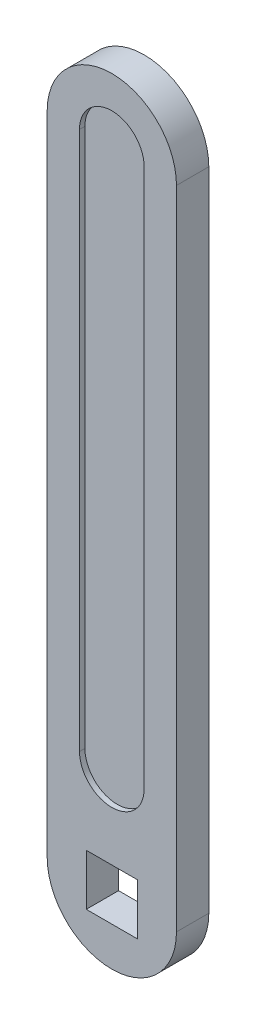
ISO-10303-21;
HEADER;
FILE_DESCRIPTION(('STEP AP214'),'2;1');
FILE_NAME('part.step','',(''),(''),'','','');
FILE_SCHEMA(('AUTOMOTIVE_DESIGN { 1 0 10303 214 1 1 1 1 }'));
ENDSEC;
DATA;
#1=APPLICATION_CONTEXT('core data for automotive mechanical design processes');
#2=APPLICATION_PROTOCOL_DEFINITION('international standard','automotive_design',2000,#1);
#3=PRODUCT_CONTEXT('',#1,'mechanical');
#4=PRODUCT('Part','Part','',(#3));
#5=PRODUCT_RELATED_PRODUCT_CATEGORY('part','',(#4));
#6=PRODUCT_DEFINITION_FORMATION('','',#4);
#7=PRODUCT_DEFINITION_CONTEXT('part definition',#1,'design');
#8=PRODUCT_DEFINITION('design','',#6,#7);
#9=PRODUCT_DEFINITION_SHAPE('','',#8);
#10=(LENGTH_UNIT() NAMED_UNIT(*) SI_UNIT(.MILLI.,.METRE.));
#11=(NAMED_UNIT(*) PLANE_ANGLE_UNIT() SI_UNIT($,.RADIAN.));
#12=(NAMED_UNIT(*) SI_UNIT($,.STERADIAN.) SOLID_ANGLE_UNIT());
#13=UNCERTAINTY_MEASURE_WITH_UNIT(LENGTH_MEASURE(1.E-05),#10,'distance_accuracy_value','');
#14=(GEOMETRIC_REPRESENTATION_CONTEXT(3) GLOBAL_UNCERTAINTY_ASSIGNED_CONTEXT((#13)) GLOBAL_UNIT_ASSIGNED_CONTEXT((#10,
#11,#12)) REPRESENTATION_CONTEXT('',''));
#15=CARTESIAN_POINT('',(0.,0.,0.));
#16=DIRECTION('',(0.,0.,1.));
#17=DIRECTION('',(1.,0.,0.));
#18=AXIS2_PLACEMENT_3D('',#15,#16,#17);
#19=CARTESIAN_POINT('',(0.,0.,-3.));
#20=DIRECTION('',(0.,0.,1.));
#21=DIRECTION('',(1.,0.,0.));
#22=AXIS2_PLACEMENT_3D('',#19,#20,#21);
#23=PLANE('',#22);
#24=DIRECTION('',(0.,-1.,0.));
#25=VECTOR('',#24,1.);
#26=CARTESIAN_POINT('',(-4.75,4.75,-3.));
#27=LINE('',#26,#25);
#28=CARTESIAN_POINT('',(-4.75,4.75,-3.));
#29=VERTEX_POINT('',#28);
#30=CARTESIAN_POINT('',(-4.75,-4.75,-3.));
#31=VERTEX_POINT('',#30);
#32=EDGE_CURVE('E210',#29,#31,#27,.T.);
#33=ORIENTED_EDGE('',*,*,#32,.T.);
#34=DIRECTION('',(1.,0.,0.));
#35=VECTOR('',#34,1.);
#36=CARTESIAN_POINT('',(4.75,-4.75,-3.));
#37=LINE('',#36,#35);
#38=CARTESIAN_POINT('',(4.75,-4.75,-3.));
#39=VERTEX_POINT('',#38);
#40=EDGE_CURVE('E229',#31,#39,#37,.T.);
#41=ORIENTED_EDGE('',*,*,#40,.T.);
#42=DIRECTION('',(0.,1.,0.));
#43=VECTOR('',#42,1.);
#44=CARTESIAN_POINT('',(4.75,4.75,-3.));
#45=LINE('',#44,#43);
#46=CARTESIAN_POINT('',(4.75,4.75,-3.));
#47=VERTEX_POINT('',#46);
#48=EDGE_CURVE('E232',#39,#47,#45,.T.);
#49=ORIENTED_EDGE('',*,*,#48,.T.);
#50=DIRECTION('',(-1.,0.,0.));
#51=VECTOR('',#50,1.);
#52=CARTESIAN_POINT('',(4.75,4.75,-3.));
#53=LINE('',#52,#51);
#54=EDGE_CURVE('E219',#47,#29,#53,.T.);
#55=ORIENTED_EDGE('',*,*,#54,.T.);
#56=EDGE_LOOP('',(#33,#41,#49,#55));
#57=FACE_BOUND('',#56,.T.);
#58=CARTESIAN_POINT('',(0.,0.,-3.));
#59=DIRECTION('',(0.,0.,1.));
#60=DIRECTION('',(1.,0.,0.));
#61=AXIS2_PLACEMENT_3D('',#58,#59,#60);
#62=CIRCLE('',#61,12.);
#63=CARTESIAN_POINT('',(-12.,0.,-3.));
#64=VERTEX_POINT('',#63);
#65=CARTESIAN_POINT('',(12.,0.,-3.));
#66=VERTEX_POINT('',#65);
#67=EDGE_CURVE('E246',#64,#66,#62,.T.);
#68=ORIENTED_EDGE('',*,*,#67,.F.);
#69=DIRECTION('',(0.,-1.,0.));
#70=VECTOR('',#69,1.);
#71=CARTESIAN_POINT('',(-12.,0.,-3.));
#72=LINE('',#71,#70);
#73=CARTESIAN_POINT('',(-12.,120.,-3.));
#74=VERTEX_POINT('',#73);
#75=EDGE_CURVE('E251',#74,#64,#72,.T.);
#76=ORIENTED_EDGE('',*,*,#75,.F.);
#77=CARTESIAN_POINT('',(0.,120.,-3.));
#78=DIRECTION('',(0.,0.,1.));
#79=DIRECTION('',(1.,0.,0.));
#80=AXIS2_PLACEMENT_3D('',#77,#78,#79);
#81=CIRCLE('',#80,12.);
#82=CARTESIAN_POINT('',(12.,120.,-3.));
#83=VERTEX_POINT('',#82);
#84=EDGE_CURVE('E262',#83,#74,#81,.T.);
#85=ORIENTED_EDGE('',*,*,#84,.F.);
#86=DIRECTION('',(0.,1.,0.));
#87=VECTOR('',#86,1.);
#88=CARTESIAN_POINT('',(12.,0.,-3.));
#89=LINE('',#88,#87);
#90=EDGE_CURVE('E260',#66,#83,#89,.T.);
#91=ORIENTED_EDGE('',*,*,#90,.F.);
#92=EDGE_LOOP('',(#68,#76,#85,#91));
#93=FACE_BOUND('',#92,.T.);
#94=CARTESIAN_POINT('',(0.,20.,-3.));
#95=DIRECTION('',(0.,0.,1.));
#96=DIRECTION('',(1.,0.,0.));
#97=AXIS2_PLACEMENT_3D('',#94,#95,#96);
#98=CIRCLE('',#97,6.);
#99=CARTESIAN_POINT('',(-6.,20.,-3.));
#100=VERTEX_POINT('',#99);
#101=CARTESIAN_POINT('',(6.,20.,-3.));
#102=VERTEX_POINT('',#101);
#103=EDGE_CURVE('E49',#100,#102,#98,.T.);
#104=ORIENTED_EDGE('',*,*,#103,.T.);
#105=DIRECTION('',(0.,1.,0.));
#106=VECTOR('',#105,1.);
#107=CARTESIAN_POINT('',(6.,20.,-3.));
#108=LINE('',#107,#106);
#109=CARTESIAN_POINT('',(6.,120.,-3.));
#110=VERTEX_POINT('',#109);
#111=EDGE_CURVE('E167',#102,#110,#108,.T.);
#112=ORIENTED_EDGE('',*,*,#111,.T.);
#113=CARTESIAN_POINT('',(0.,120.,-3.));
#114=DIRECTION('',(0.,0.,1.));
#115=DIRECTION('',(1.,0.,0.));
#116=AXIS2_PLACEMENT_3D('',#113,#114,#115);
#117=CIRCLE('',#116,6.);
#118=CARTESIAN_POINT('',(-6.,120.,-3.));
#119=VERTEX_POINT('',#118);
#120=EDGE_CURVE('E170',#110,#119,#117,.T.);
#121=ORIENTED_EDGE('',*,*,#120,.T.);
#122=DIRECTION('',(0.,-1.,0.));
#123=VECTOR('',#122,1.);
#124=CARTESIAN_POINT('',(-6.,20.,-3.));
#125=LINE('',#124,#123);
#126=EDGE_CURVE('E176',#119,#100,#125,.T.);
#127=ORIENTED_EDGE('',*,*,#126,.T.);
#128=EDGE_LOOP('',(#104,#112,#121,#127));
#129=FACE_BOUND('',#128,.T.);
#130=ADVANCED_FACE('F34',(#57,#93,#129),#23,.F.);
#131=CARTESIAN_POINT('',(0.,0.,3.));
#132=DIRECTION('',(0.,0.,1.));
#133=DIRECTION('',(1.,0.,0.));
#134=AXIS2_PLACEMENT_3D('',#131,#132,#133);
#135=PLANE('',#134);
#136=CARTESIAN_POINT('',(0.,20.,3.));
#137=DIRECTION('',(0.,0.,1.));
#138=DIRECTION('',(1.,0.,0.));
#139=AXIS2_PLACEMENT_3D('',#136,#137,#138);
#140=CIRCLE('',#139,6.);
#141=CARTESIAN_POINT('',(-6.,20.,3.));
#142=VERTEX_POINT('',#141);
#143=CARTESIAN_POINT('',(6.,20.,3.));
#144=VERTEX_POINT('',#143);
#145=EDGE_CURVE('E57',#142,#144,#140,.T.);
#146=ORIENTED_EDGE('',*,*,#145,.F.);
#147=DIRECTION('',(0.,-1.,0.));
#148=VECTOR('',#147,1.);
#149=CARTESIAN_POINT('',(-6.,20.,3.));
#150=LINE('',#149,#148);
#151=CARTESIAN_POINT('',(-6.,120.,3.));
#152=VERTEX_POINT('',#151);
#153=EDGE_CURVE('E189',#152,#142,#150,.T.);
#154=ORIENTED_EDGE('',*,*,#153,.F.);
#155=CARTESIAN_POINT('',(0.,120.,3.));
#156=DIRECTION('',(0.,0.,1.));
#157=DIRECTION('',(1.,0.,0.));
#158=AXIS2_PLACEMENT_3D('',#155,#156,#157);
#159=CIRCLE('',#158,6.);
#160=CARTESIAN_POINT('',(6.,120.,3.));
#161=VERTEX_POINT('',#160);
#162=EDGE_CURVE('E203',#161,#152,#159,.T.);
#163=ORIENTED_EDGE('',*,*,#162,.F.);
#164=DIRECTION('',(0.,1.,0.));
#165=VECTOR('',#164,1.);
#166=CARTESIAN_POINT('',(6.,20.,3.));
#167=LINE('',#166,#165);
#168=EDGE_CURVE('E200',#144,#161,#167,.T.);
#169=ORIENTED_EDGE('',*,*,#168,.F.);
#170=EDGE_LOOP('',(#146,#154,#163,#169));
#171=FACE_BOUND('',#170,.T.);
#172=CARTESIAN_POINT('',(0.,0.,3.));
#173=DIRECTION('',(0.,0.,1.));
#174=DIRECTION('',(1.,0.,0.));
#175=AXIS2_PLACEMENT_3D('',#172,#173,#174);
#176=CIRCLE('',#175,12.);
#177=CARTESIAN_POINT('',(-12.,0.,3.));
#178=VERTEX_POINT('',#177);
#179=CARTESIAN_POINT('',(12.,0.,3.));
#180=VERTEX_POINT('',#179);
#181=EDGE_CURVE('E247',#178,#180,#176,.T.);
#182=ORIENTED_EDGE('',*,*,#181,.T.);
#183=DIRECTION('',(0.,1.,0.));
#184=VECTOR('',#183,1.);
#185=CARTESIAN_POINT('',(12.,0.,3.));
#186=LINE('',#185,#184);
#187=CARTESIAN_POINT('',(12.,120.,3.));
#188=VERTEX_POINT('',#187);
#189=EDGE_CURVE('E250',#180,#188,#186,.T.);
#190=ORIENTED_EDGE('',*,*,#189,.T.);
#191=CARTESIAN_POINT('',(0.,120.,3.));
#192=DIRECTION('',(0.,0.,1.));
#193=DIRECTION('',(1.,0.,0.));
#194=AXIS2_PLACEMENT_3D('',#191,#192,#193);
#195=CIRCLE('',#194,12.);
#196=CARTESIAN_POINT('',(-12.,120.,3.));
#197=VERTEX_POINT('',#196);
#198=EDGE_CURVE('E253',#188,#197,#195,.T.);
#199=ORIENTED_EDGE('',*,*,#198,.T.);
#200=DIRECTION('',(0.,-1.,0.));
#201=VECTOR('',#200,1.);
#202=CARTESIAN_POINT('',(-12.,0.,3.));
#203=LINE('',#202,#201);
#204=EDGE_CURVE('E255',#197,#178,#203,.T.);
#205=ORIENTED_EDGE('',*,*,#204,.T.);
#206=EDGE_LOOP('',(#182,#190,#199,#205));
#207=FACE_BOUND('',#206,.T.);
#208=DIRECTION('',(1.,0.,0.));
#209=VECTOR('',#208,1.);
#210=CARTESIAN_POINT('',(4.75,-4.75,3.));
#211=LINE('',#210,#209);
#212=CARTESIAN_POINT('',(-4.75,-4.75,3.));
#213=VERTEX_POINT('',#212);
#214=CARTESIAN_POINT('',(4.75,-4.75,3.));
#215=VERTEX_POINT('',#214);
#216=EDGE_CURVE('E218',#213,#215,#211,.T.);
#217=ORIENTED_EDGE('',*,*,#216,.F.);
#218=DIRECTION('',(0.,-1.,0.));
#219=VECTOR('',#218,1.);
#220=CARTESIAN_POINT('',(-4.75,4.75,3.));
#221=LINE('',#220,#219);
#222=CARTESIAN_POINT('',(-4.75,4.75,3.));
#223=VERTEX_POINT('',#222);
#224=EDGE_CURVE('E216',#223,#213,#221,.T.);
#225=ORIENTED_EDGE('',*,*,#224,.F.);
#226=DIRECTION('',(-1.,0.,0.));
#227=VECTOR('',#226,1.);
#228=CARTESIAN_POINT('',(4.75,4.75,3.));
#229=LINE('',#228,#227);
#230=CARTESIAN_POINT('',(4.75,4.75,3.));
#231=VERTEX_POINT('',#230);
#232=EDGE_CURVE('E224',#231,#223,#229,.T.);
#233=ORIENTED_EDGE('',*,*,#232,.F.);
#234=DIRECTION('',(0.,1.,0.));
#235=VECTOR('',#234,1.);
#236=CARTESIAN_POINT('',(4.75,4.75,3.));
#237=LINE('',#236,#235);
#238=EDGE_CURVE('E221',#215,#231,#237,.T.);
#239=ORIENTED_EDGE('',*,*,#238,.F.);
#240=EDGE_LOOP('',(#217,#225,#233,#239));
#241=FACE_BOUND('',#240,.T.);
#242=ADVANCED_FACE('F289',(#171,#207,#241),#135,.T.);
#243=CARTESIAN_POINT('',(0.,0.,3.));
#244=DIRECTION('',(0.,0.,-1.));
#245=DIRECTION('',(-1.,0.,0.));
#246=AXIS2_PLACEMENT_3D('',#243,#244,#245);
#247=CYLINDRICAL_SURFACE('',#246,12.);
#248=ORIENTED_EDGE('',*,*,#67,.T.);
#249=DIRECTION('',(0.,0.,-1.));
#250=VECTOR('',#249,1.);
#251=CARTESIAN_POINT('',(12.,0.,3.));
#252=LINE('',#251,#250);
#253=EDGE_CURVE('E11',#180,#66,#252,.T.);
#254=ORIENTED_EDGE('',*,*,#253,.F.);
#255=ORIENTED_EDGE('',*,*,#181,.F.);
#256=DIRECTION('',(0.,0.,-1.));
#257=VECTOR('',#256,1.);
#258=CARTESIAN_POINT('',(-12.,0.,3.));
#259=LINE('',#258,#257);
#260=EDGE_CURVE('E257',#178,#64,#259,.T.);
#261=ORIENTED_EDGE('',*,*,#260,.T.);
#262=EDGE_LOOP('',(#248,#254,#255,#261));
#263=FACE_BOUND('',#262,.T.);
#264=ADVANCED_FACE('F36',(#263),#247,.T.);
#265=CARTESIAN_POINT('',(12.,0.,3.));
#266=DIRECTION('',(-1.,0.,0.));
#267=DIRECTION('',(0.,-1.,0.));
#268=AXIS2_PLACEMENT_3D('',#265,#266,#267);
#269=PLANE('',#268);
#270=ORIENTED_EDGE('',*,*,#90,.T.);
#271=DIRECTION('',(0.,0.,-1.));
#272=VECTOR('',#271,1.);
#273=CARTESIAN_POINT('',(12.,120.,3.));
#274=LINE('',#273,#272);
#275=EDGE_CURVE('E42',#188,#83,#274,.T.);
#276=ORIENTED_EDGE('',*,*,#275,.F.);
#277=ORIENTED_EDGE('',*,*,#189,.F.);
#278=ORIENTED_EDGE('',*,*,#253,.T.);
#279=EDGE_LOOP('',(#270,#276,#277,#278));
#280=FACE_BOUND('',#279,.T.);
#281=ADVANCED_FACE('F291',(#280),#269,.F.);
#282=CARTESIAN_POINT('',(0.,120.,3.));
#283=DIRECTION('',(0.,0.,-1.));
#284=DIRECTION('',(-1.,0.,0.));
#285=AXIS2_PLACEMENT_3D('',#282,#283,#284);
#286=CYLINDRICAL_SURFACE('',#285,12.);
#287=ORIENTED_EDGE('',*,*,#84,.T.);
#288=DIRECTION('',(0.,0.,-1.));
#289=VECTOR('',#288,1.);
#290=CARTESIAN_POINT('',(-12.,120.,3.));
#291=LINE('',#290,#289);
#292=EDGE_CURVE('E267',#197,#74,#291,.T.);
#293=ORIENTED_EDGE('',*,*,#292,.F.);
#294=ORIENTED_EDGE('',*,*,#198,.F.);
#295=ORIENTED_EDGE('',*,*,#275,.T.);
#296=EDGE_LOOP('',(#287,#293,#294,#295));
#297=FACE_BOUND('',#296,.T.);
#298=ADVANCED_FACE('F274',(#297),#286,.T.);
#299=CARTESIAN_POINT('',(-12.,0.,3.));
#300=DIRECTION('',(1.,0.,0.));
#301=DIRECTION('',(0.,1.,0.));
#302=AXIS2_PLACEMENT_3D('',#299,#300,#301);
#303=PLANE('',#302);
#304=ORIENTED_EDGE('',*,*,#75,.T.);
#305=ORIENTED_EDGE('',*,*,#260,.F.);
#306=ORIENTED_EDGE('',*,*,#204,.F.);
#307=ORIENTED_EDGE('',*,*,#292,.T.);
#308=EDGE_LOOP('',(#304,#305,#306,#307));
#309=FACE_BOUND('',#308,.T.);
#310=ADVANCED_FACE('F283',(#309),#303,.F.);
#311=CARTESIAN_POINT('',(-4.75,4.75,3.));
#312=DIRECTION('',(1.,0.,0.));
#313=DIRECTION('',(0.,1.,0.));
#314=AXIS2_PLACEMENT_3D('',#311,#312,#313);
#315=PLANE('',#314);
#316=ORIENTED_EDGE('',*,*,#32,.F.);
#317=DIRECTION('',(0.,0.,-1.));
#318=VECTOR('',#317,1.);
#319=CARTESIAN_POINT('',(-4.75,4.75,3.));
#320=LINE('',#319,#318);
#321=EDGE_CURVE('E226',#223,#29,#320,.T.);
#322=ORIENTED_EDGE('',*,*,#321,.F.);
#323=ORIENTED_EDGE('',*,*,#224,.T.);
#324=DIRECTION('',(0.,0.,-1.));
#325=VECTOR('',#324,1.);
#326=CARTESIAN_POINT('',(-4.75,-4.75,3.));
#327=LINE('',#326,#325);
#328=EDGE_CURVE('E243',#213,#31,#327,.T.);
#329=ORIENTED_EDGE('',*,*,#328,.T.);
#330=EDGE_LOOP('',(#316,#322,#323,#329));
#331=FACE_BOUND('',#330,.T.);
#332=ADVANCED_FACE('F309',(#331),#315,.T.);
#333=CARTESIAN_POINT('',(4.75,-4.75,3.));
#334=DIRECTION('',(0.,1.,0.));
#335=DIRECTION('',(-1.,0.,0.));
#336=AXIS2_PLACEMENT_3D('',#333,#334,#335);
#337=PLANE('',#336);
#338=ORIENTED_EDGE('',*,*,#40,.F.);
#339=ORIENTED_EDGE('',*,*,#328,.F.);
#340=ORIENTED_EDGE('',*,*,#216,.T.);
#341=DIRECTION('',(0.,0.,-1.));
#342=VECTOR('',#341,1.);
#343=CARTESIAN_POINT('',(4.75,-4.75,3.));
#344=LINE('',#343,#342);
#345=EDGE_CURVE('E241',#215,#39,#344,.T.);
#346=ORIENTED_EDGE('',*,*,#345,.T.);
#347=EDGE_LOOP('',(#338,#339,#340,#346));
#348=FACE_BOUND('',#347,.T.);
#349=ADVANCED_FACE('F313',(#348),#337,.T.);
#350=CARTESIAN_POINT('',(4.75,4.75,3.));
#351=DIRECTION('',(-1.,0.,0.));
#352=DIRECTION('',(0.,-1.,0.));
#353=AXIS2_PLACEMENT_3D('',#350,#351,#352);
#354=PLANE('',#353);
#355=ORIENTED_EDGE('',*,*,#48,.F.);
#356=ORIENTED_EDGE('',*,*,#345,.F.);
#357=ORIENTED_EDGE('',*,*,#238,.T.);
#358=DIRECTION('',(0.,0.,-1.));
#359=VECTOR('',#358,1.);
#360=CARTESIAN_POINT('',(4.75,4.75,3.));
#361=LINE('',#360,#359);
#362=EDGE_CURVE('E239',#231,#47,#361,.T.);
#363=ORIENTED_EDGE('',*,*,#362,.T.);
#364=EDGE_LOOP('',(#355,#356,#357,#363));
#365=FACE_BOUND('',#364,.T.);
#366=ADVANCED_FACE('F318',(#365),#354,.T.);
#367=CARTESIAN_POINT('',(4.75,4.75,3.));
#368=DIRECTION('',(0.,-1.,0.));
#369=DIRECTION('',(0.,0.,-1.));
#370=AXIS2_PLACEMENT_3D('',#367,#368,#369);
#371=PLANE('',#370);
#372=ORIENTED_EDGE('',*,*,#54,.F.);
#373=ORIENTED_EDGE('',*,*,#362,.F.);
#374=ORIENTED_EDGE('',*,*,#232,.T.);
#375=ORIENTED_EDGE('',*,*,#321,.T.);
#376=EDGE_LOOP('',(#372,#373,#374,#375));
#377=FACE_BOUND('',#376,.T.);
#378=ADVANCED_FACE('F324',(#377),#371,.T.);
#379=CARTESIAN_POINT('',(0.,20.,2.));
#380=DIRECTION('',(0.,0.,1.));
#381=DIRECTION('',(1.,0.,0.));
#382=AXIS2_PLACEMENT_3D('',#379,#380,#381);
#383=CYLINDRICAL_SURFACE('',#382,6.);
#384=ORIENTED_EDGE('',*,*,#145,.T.);
#385=DIRECTION('',(0.,0.,1.));
#386=VECTOR('',#385,1.);
#387=CARTESIAN_POINT('',(6.,20.,2.));
#388=LINE('',#387,#386);
#389=CARTESIAN_POINT('',(6.,20.,2.));
#390=VERTEX_POINT('',#389);
#391=EDGE_CURVE('E198',#390,#144,#388,.T.);
#392=ORIENTED_EDGE('',*,*,#391,.F.);
#393=CARTESIAN_POINT('',(0.,20.,2.));
#394=DIRECTION('',(0.,0.,1.));
#395=DIRECTION('',(1.,0.,0.));
#396=AXIS2_PLACEMENT_3D('',#393,#394,#395);
#397=CIRCLE('',#396,6.);
#398=CARTESIAN_POINT('',(-6.,20.,2.));
#399=VERTEX_POINT('',#398);
#400=EDGE_CURVE('E185',#399,#390,#397,.T.);
#401=ORIENTED_EDGE('',*,*,#400,.F.);
#402=DIRECTION('',(0.,0.,1.));
#403=VECTOR('',#402,1.);
#404=CARTESIAN_POINT('',(-6.,20.,2.));
#405=LINE('',#404,#403);
#406=EDGE_CURVE('E208',#399,#142,#405,.T.);
#407=ORIENTED_EDGE('',*,*,#406,.T.);
#408=EDGE_LOOP('',(#384,#392,#401,#407));
#409=FACE_BOUND('',#408,.T.);
#410=ADVANCED_FACE('F328',(#409),#383,.F.);
#411=CARTESIAN_POINT('',(-6.,20.,2.));
#412=DIRECTION('',(-1.,0.,0.));
#413=DIRECTION('',(0.,0.,1.));
#414=AXIS2_PLACEMENT_3D('',#411,#412,#413);
#415=PLANE('',#414);
#416=ORIENTED_EDGE('',*,*,#153,.T.);
#417=ORIENTED_EDGE('',*,*,#406,.F.);
#418=DIRECTION('',(0.,-1.,0.));
#419=VECTOR('',#418,1.);
#420=CARTESIAN_POINT('',(-6.,20.,2.));
#421=LINE('',#420,#419);
#422=CARTESIAN_POINT('',(-6.,120.,2.));
#423=VERTEX_POINT('',#422);
#424=EDGE_CURVE('E195',#423,#399,#421,.T.);
#425=ORIENTED_EDGE('',*,*,#424,.F.);
#426=DIRECTION('',(0.,0.,1.));
#427=VECTOR('',#426,1.);
#428=CARTESIAN_POINT('',(-6.,120.,2.));
#429=LINE('',#428,#427);
#430=EDGE_CURVE('E211',#423,#152,#429,.T.);
#431=ORIENTED_EDGE('',*,*,#430,.T.);
#432=EDGE_LOOP('',(#416,#417,#425,#431));
#433=FACE_BOUND('',#432,.T.);
#434=ADVANCED_FACE('F332',(#433),#415,.F.);
#435=CARTESIAN_POINT('',(0.,120.,2.));
#436=DIRECTION('',(0.,0.,1.));
#437=DIRECTION('',(1.,0.,0.));
#438=AXIS2_PLACEMENT_3D('',#435,#436,#437);
#439=CYLINDRICAL_SURFACE('',#438,6.);
#440=ORIENTED_EDGE('',*,*,#162,.T.);
#441=ORIENTED_EDGE('',*,*,#430,.F.);
#442=CARTESIAN_POINT('',(0.,120.,2.));
#443=DIRECTION('',(0.,0.,1.));
#444=DIRECTION('',(1.,0.,0.));
#445=AXIS2_PLACEMENT_3D('',#442,#443,#444);
#446=CIRCLE('',#445,6.);
#447=CARTESIAN_POINT('',(6.,120.,2.));
#448=VERTEX_POINT('',#447);
#449=EDGE_CURVE('E192',#448,#423,#446,.T.);
#450=ORIENTED_EDGE('',*,*,#449,.F.);
#451=DIRECTION('',(0.,0.,1.));
#452=VECTOR('',#451,1.);
#453=CARTESIAN_POINT('',(6.,120.,2.));
#454=LINE('',#453,#452);
#455=EDGE_CURVE('E213',#448,#161,#454,.T.);
#456=ORIENTED_EDGE('',*,*,#455,.T.);
#457=EDGE_LOOP('',(#440,#441,#450,#456));
#458=FACE_BOUND('',#457,.T.);
#459=ADVANCED_FACE('F337',(#458),#439,.F.);
#460=CARTESIAN_POINT('',(6.,20.,2.));
#461=DIRECTION('',(1.,0.,0.));
#462=DIRECTION('',(0.,0.,-1.));
#463=AXIS2_PLACEMENT_3D('',#460,#461,#462);
#464=PLANE('',#463);
#465=ORIENTED_EDGE('',*,*,#168,.T.);
#466=ORIENTED_EDGE('',*,*,#455,.F.);
#467=DIRECTION('',(0.,1.,0.));
#468=VECTOR('',#467,1.);
#469=CARTESIAN_POINT('',(6.,20.,2.));
#470=LINE('',#469,#468);
#471=EDGE_CURVE('E188',#390,#448,#470,.T.);
#472=ORIENTED_EDGE('',*,*,#471,.F.);
#473=ORIENTED_EDGE('',*,*,#391,.T.);
#474=EDGE_LOOP('',(#465,#466,#472,#473));
#475=FACE_BOUND('',#474,.T.);
#476=ADVANCED_FACE('F333',(#475),#464,.F.);
#477=CARTESIAN_POINT('',(0.,20.,2.));
#478=DIRECTION('',(0.,0.,1.));
#479=DIRECTION('',(1.,0.,0.));
#480=AXIS2_PLACEMENT_3D('',#477,#478,#479);
#481=PLANE('',#480);
#482=ORIENTED_EDGE('',*,*,#400,.T.);
#483=ORIENTED_EDGE('',*,*,#471,.T.);
#484=ORIENTED_EDGE('',*,*,#449,.T.);
#485=ORIENTED_EDGE('',*,*,#424,.T.);
#486=EDGE_LOOP('',(#482,#483,#484,#485));
#487=FACE_BOUND('',#486,.T.);
#488=ADVANCED_FACE('F336',(#487),#481,.T.);
#489=CARTESIAN_POINT('',(0.,20.,-2.));
#490=DIRECTION('',(0.,0.,-1.));
#491=DIRECTION('',(-1.,0.,0.));
#492=AXIS2_PLACEMENT_3D('',#489,#490,#491);
#493=CYLINDRICAL_SURFACE('',#492,6.);
#494=ORIENTED_EDGE('',*,*,#103,.F.);
#495=DIRECTION('',(0.,0.,-1.));
#496=VECTOR('',#495,1.);
#497=CARTESIAN_POINT('',(-6.,20.,-2.));
#498=LINE('',#497,#496);
#499=CARTESIAN_POINT('',(-6.,20.,-2.));
#500=VERTEX_POINT('',#499);
#501=EDGE_CURVE('E152',#500,#100,#498,.T.);
#502=ORIENTED_EDGE('',*,*,#501,.F.);
#503=CARTESIAN_POINT('',(0.,20.,-2.));
#504=DIRECTION('',(0.,0.,1.));
#505=DIRECTION('',(1.,0.,0.));
#506=AXIS2_PLACEMENT_3D('',#503,#504,#505);
#507=CIRCLE('',#506,6.);
#508=CARTESIAN_POINT('',(6.,20.,-2.));
#509=VERTEX_POINT('',#508);
#510=EDGE_CURVE('E159',#500,#509,#507,.T.);
#511=ORIENTED_EDGE('',*,*,#510,.T.);
#512=DIRECTION('',(0.,0.,-1.));
#513=VECTOR('',#512,1.);
#514=CARTESIAN_POINT('',(6.,20.,-2.));
#515=LINE('',#514,#513);
#516=EDGE_CURVE('E180',#509,#102,#515,.T.);
#517=ORIENTED_EDGE('',*,*,#516,.T.);
#518=EDGE_LOOP('',(#494,#502,#511,#517));
#519=FACE_BOUND('',#518,.T.);
#520=ADVANCED_FACE('F162',(#519),#493,.F.);
#521=CARTESIAN_POINT('',(6.,20.,-2.));
#522=DIRECTION('',(-1.,0.,0.));
#523=DIRECTION('',(0.,0.,1.));
#524=AXIS2_PLACEMENT_3D('',#521,#522,#523);
#525=PLANE('',#524);
#526=ORIENTED_EDGE('',*,*,#111,.F.);
#527=ORIENTED_EDGE('',*,*,#516,.F.);
#528=DIRECTION('',(0.,1.,0.));
#529=VECTOR('',#528,1.);
#530=CARTESIAN_POINT('',(6.,20.,-2.));
#531=LINE('',#530,#529);
#532=CARTESIAN_POINT('',(6.,120.,-2.));
#533=VERTEX_POINT('',#532);
#534=EDGE_CURVE('E164',#509,#533,#531,.T.);
#535=ORIENTED_EDGE('',*,*,#534,.T.);
#536=DIRECTION('',(0.,0.,-1.));
#537=VECTOR('',#536,1.);
#538=CARTESIAN_POINT('',(6.,120.,-2.));
#539=LINE('',#538,#537);
#540=EDGE_CURVE('E182',#533,#110,#539,.T.);
#541=ORIENTED_EDGE('',*,*,#540,.T.);
#542=EDGE_LOOP('',(#526,#527,#535,#541));
#543=FACE_BOUND('',#542,.T.);
#544=ADVANCED_FACE('F350',(#543),#525,.T.);
#545=CARTESIAN_POINT('',(0.,120.,-2.));
#546=DIRECTION('',(0.,0.,-1.));
#547=DIRECTION('',(-1.,0.,0.));
#548=AXIS2_PLACEMENT_3D('',#545,#546,#547);
#549=CYLINDRICAL_SURFACE('',#548,6.);
#550=ORIENTED_EDGE('',*,*,#120,.F.);
#551=ORIENTED_EDGE('',*,*,#540,.F.);
#552=CARTESIAN_POINT('',(0.,120.,-2.));
#553=DIRECTION('',(0.,0.,1.));
#554=DIRECTION('',(1.,0.,0.));
#555=AXIS2_PLACEMENT_3D('',#552,#553,#554);
#556=CIRCLE('',#555,6.);
#557=CARTESIAN_POINT('',(-6.,120.,-2.));
#558=VERTEX_POINT('',#557);
#559=EDGE_CURVE('E158',#533,#558,#556,.T.);
#560=ORIENTED_EDGE('',*,*,#559,.T.);
#561=DIRECTION('',(0.,0.,-1.));
#562=VECTOR('',#561,1.);
#563=CARTESIAN_POINT('',(-6.,120.,-2.));
#564=LINE('',#563,#562);
#565=EDGE_CURVE('E154',#558,#119,#564,.T.);
#566=ORIENTED_EDGE('',*,*,#565,.T.);
#567=EDGE_LOOP('',(#550,#551,#560,#566));
#568=FACE_BOUND('',#567,.T.);
#569=ADVANCED_FACE('F353',(#568),#549,.F.);
#570=CARTESIAN_POINT('',(-6.,20.,-2.));
#571=DIRECTION('',(1.,0.,0.));
#572=DIRECTION('',(0.,0.,-1.));
#573=AXIS2_PLACEMENT_3D('',#570,#571,#572);
#574=PLANE('',#573);
#575=ORIENTED_EDGE('',*,*,#126,.F.);
#576=ORIENTED_EDGE('',*,*,#565,.F.);
#577=DIRECTION('',(0.,-1.,0.));
#578=VECTOR('',#577,1.);
#579=CARTESIAN_POINT('',(-6.,20.,-2.));
#580=LINE('',#579,#578);
#581=EDGE_CURVE('E149',#558,#500,#580,.T.);
#582=ORIENTED_EDGE('',*,*,#581,.T.);
#583=ORIENTED_EDGE('',*,*,#501,.T.);
#584=EDGE_LOOP('',(#575,#576,#582,#583));
#585=FACE_BOUND('',#584,.T.);
#586=ADVANCED_FACE('F151',(#585),#574,.T.);
#587=CARTESIAN_POINT('',(0.,20.,-2.));
#588=DIRECTION('',(0.,0.,-1.));
#589=DIRECTION('',(1.,0.,0.));
#590=AXIS2_PLACEMENT_3D('',#587,#588,#589);
#591=PLANE('',#590);
#592=ORIENTED_EDGE('',*,*,#510,.F.);
#593=ORIENTED_EDGE('',*,*,#581,.F.);
#594=ORIENTED_EDGE('',*,*,#559,.F.);
#595=ORIENTED_EDGE('',*,*,#534,.F.);
#596=EDGE_LOOP('',(#592,#593,#594,#595));
#597=FACE_BOUND('',#596,.T.);
#598=ADVANCED_FACE('F166',(#597),#591,.T.);
#599=CLOSED_SHELL('',(#130,#242,#264,#281,#298,#310,#332,#349,#366,#378,#410,#434,#459,#476,
#488,#520,#544,#569,#586,#598));
#600=MANIFOLD_SOLID_BREP('B2',#599);
#601=ADVANCED_BREP_SHAPE_REPRESENTATION('',(#18,#600),#14);
#602=SHAPE_DEFINITION_REPRESENTATION(#9,#601);
ENDSEC;
END-ISO-10303-21;
